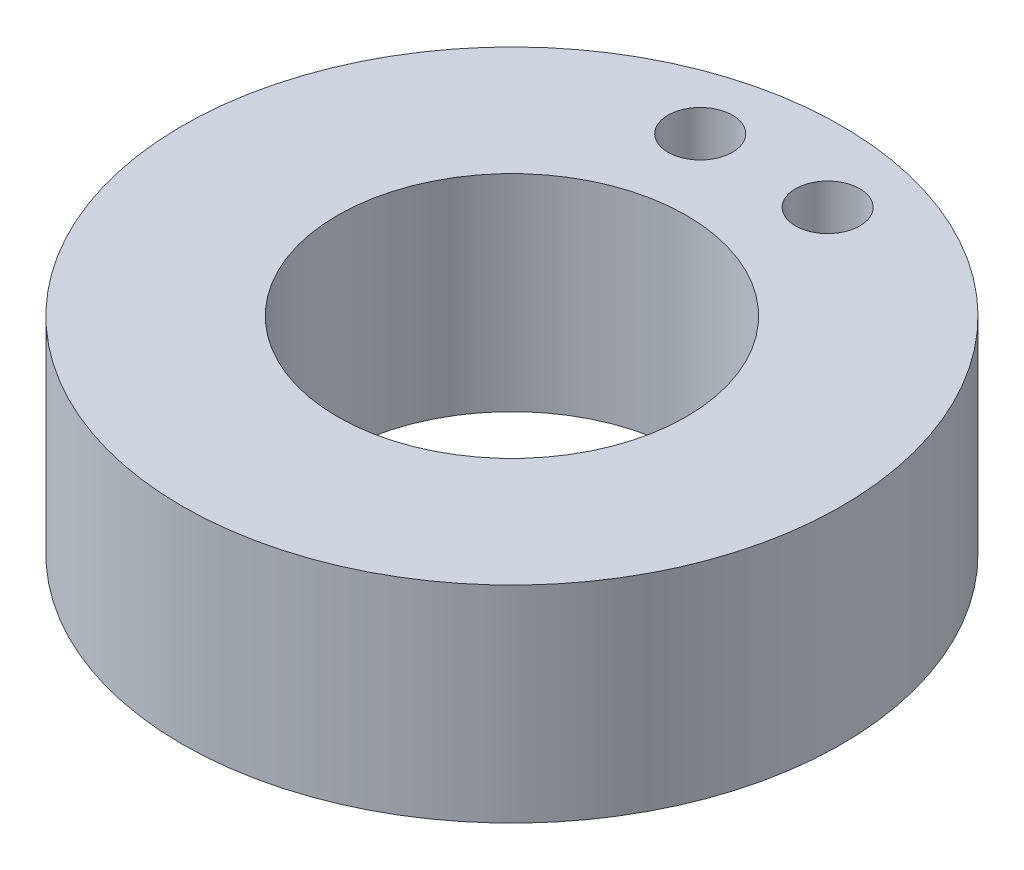
ISO-10303-21;
HEADER;
FILE_DESCRIPTION(('STEP AP214'),'2;1');
FILE_NAME('part.step','',(''),(''),'','','');
FILE_SCHEMA(('AUTOMOTIVE_DESIGN { 1 0 10303 214 1 1 1 1 }'));
ENDSEC;
DATA;
#1=APPLICATION_CONTEXT('core data for automotive mechanical design processes');
#2=APPLICATION_PROTOCOL_DEFINITION('international standard','automotive_design',2000,#1);
#3=PRODUCT_CONTEXT('',#1,'mechanical');
#4=PRODUCT('Part','Part','',(#3));
#5=PRODUCT_RELATED_PRODUCT_CATEGORY('part','',(#4));
#6=PRODUCT_DEFINITION_FORMATION('','',#4);
#7=PRODUCT_DEFINITION_CONTEXT('part definition',#1,'design');
#8=PRODUCT_DEFINITION('design','',#6,#7);
#9=PRODUCT_DEFINITION_SHAPE('','',#8);
#10=(LENGTH_UNIT() NAMED_UNIT(*) SI_UNIT(.MILLI.,.METRE.));
#11=(NAMED_UNIT(*) PLANE_ANGLE_UNIT() SI_UNIT($,.RADIAN.));
#12=(NAMED_UNIT(*) SI_UNIT($,.STERADIAN.) SOLID_ANGLE_UNIT());
#13=UNCERTAINTY_MEASURE_WITH_UNIT(LENGTH_MEASURE(1.E-05),#10,'distance_accuracy_value','');
#14=(GEOMETRIC_REPRESENTATION_CONTEXT(3) GLOBAL_UNCERTAINTY_ASSIGNED_CONTEXT((#13)) GLOBAL_UNIT_ASSIGNED_CONTEXT((#10,
#11,#12)) REPRESENTATION_CONTEXT('',''));
#15=CARTESIAN_POINT('',(0.,0.,0.));
#16=DIRECTION('',(0.,0.,1.));
#17=DIRECTION('',(1.,0.,0.));
#18=AXIS2_PLACEMENT_3D('',#15,#16,#17);
#19=CARTESIAN_POINT('',(0.,10.16,0.));
#20=DIRECTION('',(0.,1.,0.));
#21=DIRECTION('',(0.,0.,1.));
#22=AXIS2_PLACEMENT_3D('',#19,#20,#21);
#23=PLANE('',#22);
#24=CARTESIAN_POINT('',(3.14031560361627,10.16,-12.4206));
#25=DIRECTION('',(0.,1.,0.));
#26=DIRECTION('',(0.,0.,1.));
#27=AXIS2_PLACEMENT_3D('',#24,#25,#26);
#28=CIRCLE('',#27,1.5875);
#29=CARTESIAN_POINT('',(3.14031560361627,10.16,-10.8331));
#30=VERTEX_POINT('',#29);
#31=EDGE_CURVE('E64',#30,#30,#28,.F.);
#32=ORIENTED_EDGE('',*,*,#31,.T.);
#33=EDGE_LOOP('',(#32));
#34=FACE_BOUND('',#33,.T.);
#35=CARTESIAN_POINT('',(0.,10.16,0.));
#36=DIRECTION('',(0.,1.,0.));
#37=DIRECTION('',(0.,0.,1.));
#38=AXIS2_PLACEMENT_3D('',#35,#36,#37);
#39=CIRCLE('',#38,16.2433);
#40=CARTESIAN_POINT('',(0.,10.16,16.2433));
#41=VERTEX_POINT('',#40);
#42=EDGE_CURVE('E41',#41,#41,#39,.T.);
#43=ORIENTED_EDGE('',*,*,#42,.T.);
#44=EDGE_LOOP('',(#43));
#45=FACE_BOUND('',#44,.T.);
#46=CARTESIAN_POINT('',(0.,10.16,0.));
#47=DIRECTION('',(0.,1.,0.));
#48=DIRECTION('',(0.,0.,1.));
#49=AXIS2_PLACEMENT_3D('',#46,#47,#48);
#50=CIRCLE('',#49,8.5979);
#51=CARTESIAN_POINT('',(0.,10.16,8.5979));
#52=VERTEX_POINT('',#51);
#53=EDGE_CURVE('E10',#52,#52,#50,.T.);
#54=ORIENTED_EDGE('',*,*,#53,.F.);
#55=EDGE_LOOP('',(#54));
#56=FACE_BOUND('',#55,.T.);
#57=CARTESIAN_POINT('',(-3.14031560361627,10.16,-12.4206));
#58=DIRECTION('',(0.,1.,0.));
#59=DIRECTION('',(0.,0.,1.));
#60=AXIS2_PLACEMENT_3D('',#57,#58,#59);
#61=CIRCLE('',#60,1.5875);
#62=CARTESIAN_POINT('',(-3.14031560361627,10.16,-10.8331));
#63=VERTEX_POINT('',#62);
#64=EDGE_CURVE('E55',#63,#63,#61,.T.);
#65=ORIENTED_EDGE('',*,*,#64,.F.);
#66=EDGE_LOOP('',(#65));
#67=FACE_BOUND('',#66,.T.);
#68=ADVANCED_FACE('F33',(#34,#45,#56,#67),#23,.T.);
#69=CARTESIAN_POINT('',(0.,0.,0.));
#70=DIRECTION('',(0.,1.,0.));
#71=DIRECTION('',(0.,0.,1.));
#72=AXIS2_PLACEMENT_3D('',#69,#70,#71);
#73=PLANE('',#72);
#74=CARTESIAN_POINT('',(0.,0.,0.));
#75=DIRECTION('',(0.,1.,0.));
#76=DIRECTION('',(0.,0.,1.));
#77=AXIS2_PLACEMENT_3D('',#74,#75,#76);
#78=CIRCLE('',#77,8.5979);
#79=CARTESIAN_POINT('',(0.,0.,8.5979));
#80=VERTEX_POINT('',#79);
#81=EDGE_CURVE('E37',#80,#80,#78,.T.);
#82=ORIENTED_EDGE('',*,*,#81,.T.);
#83=EDGE_LOOP('',(#82));
#84=FACE_BOUND('',#83,.T.);
#85=CARTESIAN_POINT('',(0.,0.,0.));
#86=DIRECTION('',(0.,1.,0.));
#87=DIRECTION('',(0.,0.,1.));
#88=AXIS2_PLACEMENT_3D('',#85,#86,#87);
#89=CIRCLE('',#88,16.2433);
#90=CARTESIAN_POINT('',(0.,0.,16.2433));
#91=VERTEX_POINT('',#90);
#92=EDGE_CURVE('E48',#91,#91,#89,.T.);
#93=ORIENTED_EDGE('',*,*,#92,.F.);
#94=EDGE_LOOP('',(#93));
#95=FACE_BOUND('',#94,.T.);
#96=CARTESIAN_POINT('',(3.14031560361627,0.,-12.4206));
#97=DIRECTION('',(0.,1.,0.));
#98=DIRECTION('',(0.,0.,1.));
#99=AXIS2_PLACEMENT_3D('',#96,#97,#98);
#100=CIRCLE('',#99,1.5875);
#101=CARTESIAN_POINT('',(3.14031560361627,0.,-10.8331));
#102=VERTEX_POINT('',#101);
#103=EDGE_CURVE('E60',#102,#102,#100,.F.);
#104=ORIENTED_EDGE('',*,*,#103,.F.);
#105=EDGE_LOOP('',(#104));
#106=FACE_BOUND('',#105,.T.);
#107=CARTESIAN_POINT('',(-3.14031560361627,0.,-12.4206));
#108=DIRECTION('',(0.,1.,0.));
#109=DIRECTION('',(0.,0.,1.));
#110=AXIS2_PLACEMENT_3D('',#107,#108,#109);
#111=CIRCLE('',#110,1.5875);
#112=CARTESIAN_POINT('',(-3.14031560361627,0.,-10.8331));
#113=VERTEX_POINT('',#112);
#114=EDGE_CURVE('E50',#113,#113,#111,.T.);
#115=ORIENTED_EDGE('',*,*,#114,.T.);
#116=EDGE_LOOP('',(#115));
#117=FACE_BOUND('',#116,.T.);
#118=ADVANCED_FACE('F84',(#84,#95,#106,#117),#73,.F.);
#119=CARTESIAN_POINT('',(0.,10.16,0.));
#120=DIRECTION('',(0.,-1.,0.));
#121=DIRECTION('',(0.,0.,-1.));
#122=AXIS2_PLACEMENT_3D('',#119,#120,#121);
#123=CYLINDRICAL_SURFACE('',#122,16.2433);
#124=ORIENTED_EDGE('',*,*,#42,.F.);
#125=EDGE_LOOP('',(#124));
#126=FACE_BOUND('',#125,.T.);
#127=ORIENTED_EDGE('',*,*,#92,.T.);
#128=EDGE_LOOP('',(#127));
#129=FACE_BOUND('',#128,.T.);
#130=ADVANCED_FACE('F35',(#126,#129),#123,.T.);
#131=CARTESIAN_POINT('',(0.,10.16,0.));
#132=DIRECTION('',(0.,-1.,0.));
#133=DIRECTION('',(0.,0.,-1.));
#134=AXIS2_PLACEMENT_3D('',#131,#132,#133);
#135=CYLINDRICAL_SURFACE('',#134,8.5979);
#136=ORIENTED_EDGE('',*,*,#53,.T.);
#137=EDGE_LOOP('',(#136));
#138=FACE_BOUND('',#137,.T.);
#139=ORIENTED_EDGE('',*,*,#81,.F.);
#140=EDGE_LOOP('',(#139));
#141=FACE_BOUND('',#140,.T.);
#142=ADVANCED_FACE('F73',(#138,#141),#135,.F.);
#143=CARTESIAN_POINT('',(3.14031560361627,0.,-12.4206));
#144=DIRECTION('',(0.,1.,0.));
#145=DIRECTION('',(0.,0.,1.));
#146=AXIS2_PLACEMENT_3D('',#143,#144,#145);
#147=CYLINDRICAL_SURFACE('',#146,1.5875);
#148=ORIENTED_EDGE('',*,*,#103,.T.);
#149=EDGE_LOOP('',(#148));
#150=FACE_BOUND('',#149,.T.);
#151=ORIENTED_EDGE('',*,*,#31,.F.);
#152=EDGE_LOOP('',(#151));
#153=FACE_BOUND('',#152,.T.);
#154=ADVANCED_FACE('F70',(#150,#153),#147,.F.);
#155=CARTESIAN_POINT('',(-3.14031560361627,0.,-12.4206));
#156=DIRECTION('',(0.,1.,0.));
#157=DIRECTION('',(0.,0.,1.));
#158=AXIS2_PLACEMENT_3D('',#155,#156,#157);
#159=CYLINDRICAL_SURFACE('',#158,1.5875);
#160=ORIENTED_EDGE('',*,*,#114,.F.);
#161=EDGE_LOOP('',(#160));
#162=FACE_BOUND('',#161,.T.);
#163=ORIENTED_EDGE('',*,*,#64,.T.);
#164=EDGE_LOOP('',(#163));
#165=FACE_BOUND('',#164,.T.);
#166=ADVANCED_FACE('F72',(#162,#165),#159,.F.);
#167=CLOSED_SHELL('',(#68,#118,#130,#142,#154,#166));
#168=MANIFOLD_SOLID_BREP('B2',#167);
#169=ADVANCED_BREP_SHAPE_REPRESENTATION('',(#18,#168),#14);
#170=SHAPE_DEFINITION_REPRESENTATION(#9,#169);
ENDSEC;
END-ISO-10303-21;
